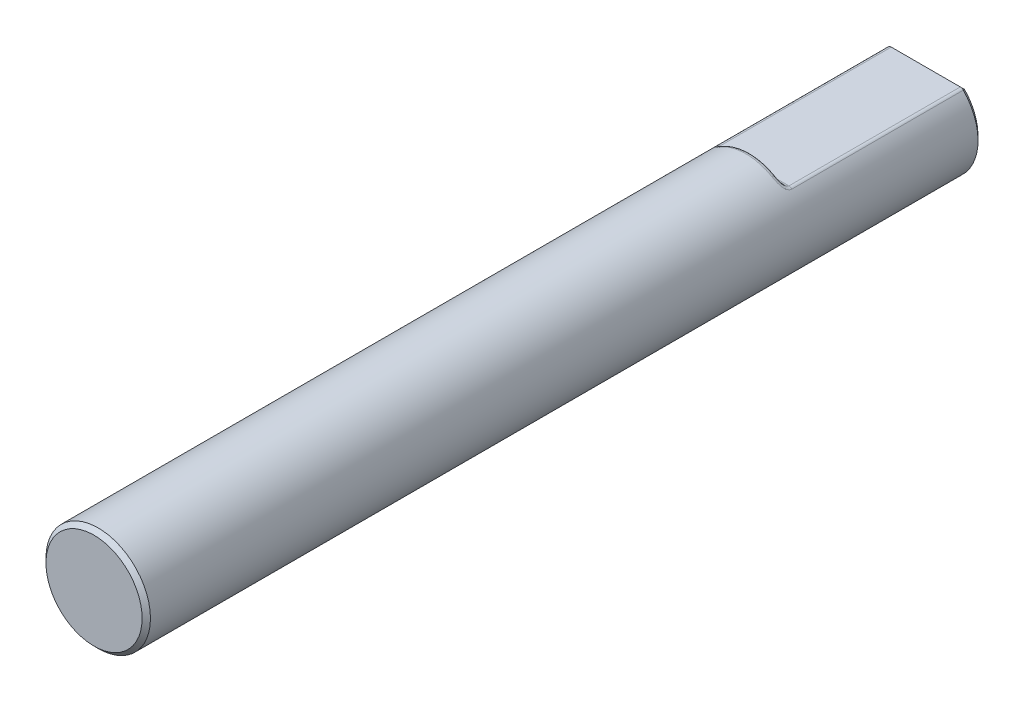
ISO-10303-21;
HEADER;
FILE_DESCRIPTION(('STEP AP214'),'2;1');
FILE_NAME('part.step','',(''),(''),'','','');
FILE_SCHEMA(('AUTOMOTIVE_DESIGN { 1 0 10303 214 1 1 1 1 }'));
ENDSEC;
DATA;
#1=APPLICATION_CONTEXT('core data for automotive mechanical design processes');
#2=APPLICATION_PROTOCOL_DEFINITION('international standard','automotive_design',2000,#1);
#3=PRODUCT_CONTEXT('',#1,'mechanical');
#4=PRODUCT('Part','Part','',(#3));
#5=PRODUCT_RELATED_PRODUCT_CATEGORY('part','',(#4));
#6=PRODUCT_DEFINITION_FORMATION('','',#4);
#7=PRODUCT_DEFINITION_CONTEXT('part definition',#1,'design');
#8=PRODUCT_DEFINITION('design','',#6,#7);
#9=PRODUCT_DEFINITION_SHAPE('','',#8);
#10=(LENGTH_UNIT() NAMED_UNIT(*) SI_UNIT(.MILLI.,.METRE.));
#11=(NAMED_UNIT(*) PLANE_ANGLE_UNIT() SI_UNIT($,.RADIAN.));
#12=(NAMED_UNIT(*) SI_UNIT($,.STERADIAN.) SOLID_ANGLE_UNIT());
#13=UNCERTAINTY_MEASURE_WITH_UNIT(LENGTH_MEASURE(1.E-05),#10,'distance_accuracy_value','');
#14=(GEOMETRIC_REPRESENTATION_CONTEXT(3) GLOBAL_UNCERTAINTY_ASSIGNED_CONTEXT((#13)) GLOBAL_UNIT_ASSIGNED_CONTEXT((#10,
#11,#12)) REPRESENTATION_CONTEXT('',''));
#15=CARTESIAN_POINT('',(0.,0.,0.));
#16=DIRECTION('',(0.,0.,1.));
#17=DIRECTION('',(1.,0.,0.));
#18=AXIS2_PLACEMENT_3D('',#15,#16,#17);
#19=CARTESIAN_POINT('',(0.,0.,50.8));
#20=DIRECTION('',(0.,0.,-1.));
#21=DIRECTION('',(-1.,0.,0.));
#22=AXIS2_PLACEMENT_3D('',#19,#20,#21);
#23=CYLINDRICAL_SURFACE('',#22,3.175);
#24=CARTESIAN_POINT('',(0.,0.,0.254000000000004));
#25=DIRECTION('',(0.,0.,1.));
#26=DIRECTION('',(1.,0.,0.));
#27=AXIS2_PLACEMENT_3D('',#24,#25,#26);
#28=CIRCLE('',#27,3.175);
#29=CARTESIAN_POINT('',(-2.28085258534348,2.20869565217391,0.254000000000004));
#30=VERTEX_POINT('',#29);
#31=CARTESIAN_POINT('',(2.28085258534348,2.20869565217391,0.254000000000004));
#32=VERTEX_POINT('',#31);
#33=EDGE_CURVE('E127',#30,#32,#28,.T.);
#34=ORIENTED_EDGE('',*,*,#33,.T.);
#35=DIRECTION('',(0.,0.,-1.));
#36=VECTOR('',#35,1.);
#37=CARTESIAN_POINT('',(2.28085258534348,2.20869565217391,50.8));
#38=LINE('',#37,#36);
#39=CARTESIAN_POINT('',(2.28085258534348,2.20869565217391,10.668));
#40=VERTEX_POINT('',#39);
#41=EDGE_CURVE('E227',#32,#40,#38,.F.);
#42=ORIENTED_EDGE('',*,*,#41,.T.);
#43=CARTESIAN_POINT('',(2.08147708691296,2.29465776440921,10.6022490499284));
#44=CARTESIAN_POINT('',(2.18936386379474,2.3017755032168,10.5756900123859));
#45=CARTESIAN_POINT('',(2.26247509447061,2.22751687915046,10.5364980998569));
#46=CARTESIAN_POINT('',(2.08704213800368,2.29182579741401,10.6127352009054));
#47=CARTESIAN_POINT('',(2.19483382835522,2.29661405397611,10.5902415242961));
#48=CARTESIAN_POINT('',(2.2685240630427,2.22136042915325,10.557470401812));
#49=CARTESIAN_POINT('',(2.09127161059837,2.28966018443801,10.6235854112991));
#50=CARTESIAN_POINT('',(2.19899567678026,2.29266629177763,10.6054541841004));
#51=CARTESIAN_POINT('',(2.2731213158654,2.21665257486143,10.5791708225988));
#52=CARTESIAN_POINT('',(2.09693841074738,2.28674969284816,10.6456238485392));
#53=CARTESIAN_POINT('',(2.20456628068673,2.28736847128426,10.6364319540538));
#54=CARTESIAN_POINT('',(2.27928088124954,2.21032541923893,10.6232476970779));
#55=CARTESIAN_POINT('',(2.09838256951604,2.28600133837143,10.6568111798799));
#56=CARTESIAN_POINT('',(2.20599150026584,2.28600284201359,10.6522216219));
#57=CARTESIAN_POINT('',(2.28085061904393,2.20869856168462,10.6456223597587));
#58=CARTESIAN_POINT('',(2.09838619099479,2.2859986590548,10.6792103368978));
#59=CARTESIAN_POINT('',(2.2059961718689,2.28599715252333,10.6838087081969));
#60=CARTESIAN_POINT('',(2.28085455542436,2.20869273706804,10.6904206737969));
#61=CARTESIAN_POINT('',(2.09694010091918,2.28674721009179,10.6904221683066));
#62=CARTESIAN_POINT('',(2.20457015007853,2.2873623338206,10.6996346421608));
#63=CARTESIAN_POINT('',(2.27928271837372,2.21032002191199,10.7128443366173));
#64=CARTESIAN_POINT('',(2.09124508751864,2.28967543925533,10.7124646912369));
#65=CARTESIAN_POINT('',(2.19896732211511,2.29269574713314,10.7306144268907));
#66=CARTESIAN_POINT('',(2.27309248644999,2.21668573753827,10.7569293824697));
#67=CARTESIAN_POINT('',(2.08699720571866,2.29185458557769,10.7232955228144));
#68=CARTESIAN_POINT('',(2.19478164244558,2.29667240400907,10.7457947946078));
#69=CARTESIAN_POINT('',(2.26847522366919,2.22142301222448,10.7785910456132));
#70=CARTESIAN_POINT('',(2.07595044465018,2.2974642569809,10.7442187468032));
#71=CARTESIAN_POINT('',(2.18392059477765,2.3069026139896,10.7748934919265));
#72=CARTESIAN_POINT('',(2.25646787455811,2.23361794985989,10.8204374936219));
#73=CARTESIAN_POINT('',(2.06916417277795,2.30088859527619,10.7543144988638));
#74=CARTESIAN_POINT('',(2.17723960723695,2.31316155570918,10.7888379839697));
#75=CARTESIAN_POINT('',(2.24909149192047,2.24106216327694,10.8406289977851));
#76=CARTESIAN_POINT('',(2.0533390852713,2.30876903921047,10.773628356883));
#77=CARTESIAN_POINT('',(2.16169366957577,2.32756298714666,10.8152092608687));
#78=CARTESIAN_POINT('',(2.23189030987301,2.25819356319842,10.8792567137962));
#79=CARTESIAN_POINT('',(2.04429730681642,2.31322650140487,10.7828452862371));
#80=CARTESIAN_POINT('',(2.15280269495554,2.33572867882211,10.8276462834935));
#81=CARTESIAN_POINT('',(2.22206229000665,2.2678836987371,10.8976905724349));
#82=CARTESIAN_POINT('',(2.02098081459409,2.32454002169663,10.8031634616703));
#83=CARTESIAN_POINT('',(2.1298989593879,2.35648115888799,10.8546466238543));
#84=CARTESIAN_POINT('',(2.19671827674762,2.29247830799507,10.938326923393));
#85=CARTESIAN_POINT('',(2.00596415863645,2.33170199441288,10.813881232634));
#86=CARTESIAN_POINT('',(2.1151434144868,2.36965333032366,10.8685247619315));
#87=CARTESIAN_POINT('',(2.18039582431238,2.30804781321404,10.9597624655657));
#88=CARTESIAN_POINT('',(1.97326577194165,2.34691281321471,10.8334930249975));
#89=CARTESIAN_POINT('',(2.08311483966224,2.39764310925851,10.8931020085138));
#90=CARTESIAN_POINT('',(2.14485409958122,2.34111481049926,10.9989860503166));
#91=CARTESIAN_POINT('',(1.95558163307324,2.35496245888326,10.8423853811602));
#92=CARTESIAN_POINT('',(2.06577703049759,2.41251048062678,10.9037877300662));
#93=CARTESIAN_POINT('',(2.12563220975182,2.35861404079051,11.0167707624204));
#94=CARTESIAN_POINT('',(1.91032606273425,2.37500469820587,10.8618052326057));
#95=CARTESIAN_POINT('',(2.02141535496309,2.44966648524454,10.9260146682914));
#96=CARTESIAN_POINT('',(2.07644137269369,2.40218412690304,11.0556104650698));
#97=CARTESIAN_POINT('',(1.88170767927852,2.38724120258011,10.8714671427826));
#98=CARTESIAN_POINT('',(1.99339768762638,2.47241543279391,10.9359028621589));
#99=CARTESIAN_POINT('',(2.04533443404104,2.4287852231007,11.0749342855267));
#100=CARTESIAN_POINT('',(1.82145126386168,2.41193885149924,10.8878579904839));
#101=CARTESIAN_POINT('',(1.93465543768717,2.51841820597802,10.9503739619204));
#102=CARTESIAN_POINT('',(1.97983833024153,2.48247576402772,11.1077159810065));
#103=CARTESIAN_POINT('',(1.78979611129448,2.42440090432795,10.8945689447679));
#104=CARTESIAN_POINT('',(1.90377328533236,2.54174707416492,10.9548168710213));
#105=CARTESIAN_POINT('',(1.94543055574109,2.50956718328915,11.1211378895483));
#106=CARTESIAN_POINT('',(1.70409217638077,2.45666350882904,10.9089348463087));
#107=CARTESIAN_POINT('',(1.81979372229936,2.60279896998063,10.960526783035));
#108=CARTESIAN_POINT('',(1.85227410478405,2.57970328011575,11.1498696925971));
#109=CARTESIAN_POINT('',(1.64833733543608,2.47621882415351,10.9145911135186));
#110=CARTESIAN_POINT('',(1.76548834456065,2.63980149990928,10.9576094400363));
#111=CARTESIAN_POINT('',(1.79167101678277,2.62221483512674,11.1611822270332));
#112=CARTESIAN_POINT('',(1.56287100562141,2.50397956699597,10.9196032814114));
#113=CARTESIAN_POINT('',(1.68382821837137,2.69197404713464,10.9467039697256));
#114=CARTESIAN_POINT('',(1.69877283219501,2.68256427607308,11.1712065628248));
#115=CARTESIAN_POINT('',(1.53434399991067,2.51289692220619,10.9207005582209));
#116=CARTESIAN_POINT('',(1.65623483168212,2.7090034987996,10.941891607098));
#117=CARTESIAN_POINT('',(1.66776521729313,2.70194983088047,11.1734011164429));
#118=CARTESIAN_POINT('',(1.47671654123674,2.5302250521972,10.921959105407));
#119=CARTESIAN_POINT('',(1.60056792251028,2.74223967470831,10.9302836248005));
#120=CARTESIAN_POINT('',(1.6051266752584,2.73961967869211,11.1759182108129));
#121=CARTESIAN_POINT('',(1.44761812910635,2.53863730506082,10.9221232532304));
#122=CARTESIAN_POINT('',(1.57245677980513,2.75844154181662,10.9234337887686));
#123=CARTESIAN_POINT('',(1.5734979664221,2.75790718491991,11.1762465064588));
#124=CARTESIAN_POINT('',(1.41823541644457,2.54679768400697,10.9219090220771));
#125=CARTESIAN_POINT('',(1.54451470751985,2.774006261644,10.9158261656988));
#126=CARTESIAN_POINT('',(1.54156023526584,2.7756471391456,11.1758180441542));
#127=(BOUNDED_SURFACE() B_SPLINE_SURFACE(3,2,((#43,#44,#45),(#46,#47,#48),(#49,#50,#51),(#52,
#53,#54),(#55,#56,#57),(#58,#59,#60),(#61,#62,#63),(#64,#65,#66),(#67,#68,#69),(#70,#71,#72),
(#73,#74,#75),(#76,#77,#78),(#79,#80,#81),(#82,#83,#84),(#85,#86,#87),(#88,#89,#90),(#91,#92,
#93),(#94,#95,#96),(#97,#98,#99),(#100,#101,#102),(#103,#104,#105),(#106,#107,#108),(#109,#110,
#111),(#112,#113,#114),(#115,#116,#117),(#118,#119,#120),(#121,#122,#123),(#124,#125,#126)),
.UNSPECIFIED.,.F.,.F.,.F.) B_SPLINE_SURFACE_WITH_KNOTS((4,2,2,2,2,2,2,2,2,2,2,2,2,4),(3,3),(0.,
0.0672104314705853,0.134255813086062,0.201430127025273,0.26857948396257,0.335399666159644,
0.402308089484164,0.491321385718032,0.580415527083602,0.706679723053762,0.833703060250032,
1.03955425802727,1.14065716571275,1.24144813718876),(0.,1.),
.UNSPECIFIED.) GEOMETRIC_REPRESENTATION_ITEM() RATIONAL_B_SPLINE_SURFACE(((1.,0.9158783432604,
1.),(1.,0.91749680132151,1.),(1.,0.918721732551247,1.),(1.,0.920359514561852,1.),(1.,
0.92077435219615,1.),(1.,0.920775090647766,1.),(1.,0.920359395835313,1.),(1.,0.91871468096907,
1.),(1.,0.917485963144106,1.),(1.,0.914268823994684,1.),(1.,0.912284156361139,1.),(1.,
0.907617155420817,1.),(1.,0.904933904254616,1.),(1.,0.897949439882381,1.),(1.,0.89340656300735,
1.),(1.,0.883384768646523,1.),(1.,0.877905004761794,1.),(1.,0.863707190237002,1.),(1.,
0.854591910951541,1.),(1.,0.835110248016913,1.),(1.,0.824736671822701,1.),(1.,0.796321963359922,
1.),(1.,0.777517554435384,1.),(1.,0.748410149790813,1.),(1.,0.738650250939946,1.),(1.,
0.718888204715718,1.),(1.,0.708886897667141,1.),(1.,0.69878597142492,1.))) REPRESENTATION_ITEM('') SURFACE());
#128=CARTESIAN_POINT('',(1.54156023526584,2.7756471391456,11.1758180441542));
#129=CARTESIAN_POINT('',(1.5734979664221,2.75790718491991,11.1762465064588));
#130=CARTESIAN_POINT('',(1.6051266752584,2.73961967869211,11.1759182108129));
#131=CARTESIAN_POINT('',(1.66776521729313,2.70194983088047,11.1734011164429));
#132=CARTESIAN_POINT('',(1.69877283219501,2.68256427607308,11.1712065628248));
#133=CARTESIAN_POINT('',(1.79167101678277,2.62221483512674,11.1611822270332));
#134=CARTESIAN_POINT('',(1.85227410478405,2.57970328011575,11.1498696925971));
#135=CARTESIAN_POINT('',(1.94543055574109,2.50956718328915,11.1211378895483));
#136=CARTESIAN_POINT('',(1.97983833024153,2.48247576402772,11.1077159810065));
#137=CARTESIAN_POINT('',(2.04533443404104,2.4287852231007,11.0749342855267));
#138=CARTESIAN_POINT('',(2.07644137269369,2.40218412690304,11.0556104650698));
#139=CARTESIAN_POINT('',(2.12563220975182,2.35861404079051,11.0167707624204));
#140=CARTESIAN_POINT('',(2.14485409958122,2.34111481049926,10.9989860503166));
#141=CARTESIAN_POINT('',(2.18039582431238,2.30804781321404,10.9597624655657));
#142=CARTESIAN_POINT('',(2.19671827674762,2.29247830799507,10.938326923393));
#143=CARTESIAN_POINT('',(2.22206229000665,2.2678836987371,10.8976905724349));
#144=CARTESIAN_POINT('',(2.23189030987301,2.25819356319842,10.8792567137962));
#145=CARTESIAN_POINT('',(2.24909149192047,2.24106216327694,10.8406289977851));
#146=CARTESIAN_POINT('',(2.25646787455811,2.23361794985989,10.8204374936219));
#147=CARTESIAN_POINT('',(2.26847522366919,2.22142301222448,10.7785910456132));
#148=CARTESIAN_POINT('',(2.27309248644999,2.21668573753827,10.7569293824697));
#149=CARTESIAN_POINT('',(2.27928271837372,2.21032002191199,10.7128443366173));
#150=CARTESIAN_POINT('',(2.28085455542436,2.20869273706804,10.6904206737969));
#151=CARTESIAN_POINT('',(2.28085061904392,2.20869856168462,10.6456223597587));
#152=CARTESIAN_POINT('',(2.27928088124954,2.21032541923893,10.6232476970779));
#153=CARTESIAN_POINT('',(2.27312131586541,2.21665257486143,10.5791708225988));
#154=CARTESIAN_POINT('',(2.2685240630427,2.22136042915325,10.557470401812));
#155=CARTESIAN_POINT('',(2.26247509447061,2.22751687915046,10.5364980998569));
#156=B_SPLINE_CURVE_WITH_KNOTS('',3,(#128,#129,#130,#131,#132,#133,#134,#135,#136,#137,#138,
#139,#140,#141,#142,#143,#144,#145,#146,#147,#148,#149,#150,#151,#152,#153,#154,#155),
.UNSPECIFIED.,.F.,.F.,(4,2,2,2,2,2,2,2,2,2,2,2,2,4),(0.,0.100790971476017,0.201893879161491,
0.407745076938732,0.534768414135002,0.661032610105162,0.750126751470732,0.8391400477046,
0.90604847102912,0.972868653226194,1.04001801016349,1.1071923241027,1.17423770571818,
1.24144813718876),.UNSPECIFIED.);
#157=CARTESIAN_POINT('',(1.56787252156188,2.76086956521513,11.176));
#158=VERTEX_POINT('',#157);
#159=EDGE_CURVE('E238',#158,#40,#156,.T.);
#160=ORIENTED_EDGE('',*,*,#159,.F.);
#161=CARTESIAN_POINT('',(0.,0.,11.176));
#162=DIRECTION('',(0.,0.,-1.));
#163=DIRECTION('',(-1.,0.,0.));
#164=AXIS2_PLACEMENT_3D('',#161,#162,#163);
#165=CIRCLE('',#164,3.175);
#166=CARTESIAN_POINT('',(-1.56787252156188,2.76086956521513,11.176));
#167=VERTEX_POINT('',#166);
#168=EDGE_CURVE('E283',#158,#167,#165,.F.);
#169=ORIENTED_EDGE('',*,*,#168,.T.);
#170=CARTESIAN_POINT('',(-0.762299234663434,2.67988837118684,10.8800076498778));
#171=CARTESIAN_POINT('',(-0.808454571196122,2.79883353609913,10.8015244187787));
#172=CARTESIAN_POINT('',(-0.830789738447543,2.92858721756073,10.8729597557011));
#173=CARTESIAN_POINT('',(-0.853124905698965,3.05834089902232,10.9443950926236));
#174=CARTESIAN_POINT('',(-0.828586124634168,3.0649747199714,11.0920152997555));
#175=CARTESIAN_POINT('',(-0.820250640114377,2.67205322069554,10.8851771222936));
#176=CARTESIAN_POINT('',(-0.867400480829563,2.79068636588262,10.8131719532479));
#177=CARTESIAN_POINT('',(-0.891541388471028,2.91580560722968,10.8856211442746));
#178=CARTESIAN_POINT('',(-0.914941398498865,3.04107868495901,10.9578892221924));
#179=CARTESIAN_POINT('',(-0.891576782731473,3.0479417841744,11.1023542448926));
#180=CARTESIAN_POINT('',(-0.877755361083727,2.66332341056633,10.8903129678));
#181=CARTESIAN_POINT('',(-0.92592877967618,2.78124472770227,10.8250620211124));
#182=CARTESIAN_POINT('',(-0.951425199159079,2.90151226555305,10.8983450372317));
#183=CARTESIAN_POINT('',(-0.976208377398107,3.02196998343128,10.9714725289282));
#184=CARTESIAN_POINT('',(-0.954081914220675,3.02896393604052,11.1126259357527));
#185=CARTESIAN_POINT('',(-0.991969683185946,2.64403509309197,10.8999690081169));
#186=CARTESIAN_POINT('',(-1.04169258045847,2.75960112540079,10.8482913709519));
#187=CARTESIAN_POINT('',(-1.06978127919812,2.86978499003571,10.9229611074155));
#188=CARTESIAN_POINT('',(-1.09718697316803,2.98015295286698,10.9974959142075));
#189=CARTESIAN_POINT('',(-1.07822791650723,2.98703281104265,11.1319380160807));
#190=CARTESIAN_POINT('',(-1.04867563922458,2.63347006104244,10.9044868998619));
#191=CARTESIAN_POINT('',(-1.09892243011284,2.74742454904997,10.8596318802492));
#192=CARTESIAN_POINT('',(-1.1282476339339,2.85233984149462,10.9348500970331));
#193=CARTESIAN_POINT('',(-1.1568943391921,2.95747962491751,11.0099416324129));
#194=CARTESIAN_POINT('',(-1.13986482524564,2.96406535003871,11.1409737994176));
#195=CARTESIAN_POINT('',(-1.16252815317474,2.61021004410484,10.9124215598666));
#196=CARTESIAN_POINT('',(-1.21352270951136,2.71979486388968,10.8811216260847));
#197=CARTESIAN_POINT('',(-1.24525649462567,2.8137550790047,10.9570370828334));
#198=CARTESIAN_POINT('',(-1.27627345706398,2.90795091162972,11.0328146121703));
#199=CARTESIAN_POINT('',(-1.26361755779691,2.91350009593807,11.1568431200567));
#200=CARTESIAN_POINT('',(-1.21964318194118,2.59746403821029,10.9158042486044));
#201=CARTESIAN_POINT('',(-1.27089237949075,2.704290954553,10.8912515754067));
#202=CARTESIAN_POINT('',(-1.30375598717389,2.79252628821361,10.9672816999427));
#203=CARTESIAN_POINT('',(-1.3359415550085,2.88103105583919,11.043209544924));
#204=CARTESIAN_POINT('',(-1.32569911079975,2.88579138761451,11.1636084983411));
#205=CARTESIAN_POINT('',(-1.33231038345131,2.57010599024989,10.9205910853952));
#206=CARTESIAN_POINT('',(-1.38386175957636,2.67019756054878,10.9088647282834));
#207=CARTESIAN_POINT('',(-1.41890340532494,2.74677756787298,10.9845746179531));
#208=CARTESIAN_POINT('',(-1.45327945016235,2.82362197790151,11.0601849922841));
#209=CARTESIAN_POINT('',(-1.44816346026832,2.82631737031352,11.1731821719086));
#210=CARTESIAN_POINT('',(-1.38786509293675,2.55549722008799,10.921998651877));
#211=CARTESIAN_POINT('',(-1.43950163114539,2.65164383103817,10.9163855501474));
#212=CARTESIAN_POINT('',(-1.47555436381539,2.72226340524148,10.9916284269442));
#213=CARTESIAN_POINT('',(-1.51099307671079,2.79317145232893,11.0668184745863));
#214=CARTESIAN_POINT('',(-1.50854901406201,2.79455917417128,11.1759973040521));
#215=CARTESIAN_POINT('',(-1.50112496213681,2.52333728166747,10.9220014495112));
#216=CARTESIAN_POINT('',(-1.55275280667336,2.61006022987343,10.9279682739116));
#217=CARTESIAN_POINT('',(-1.59089564996183,2.668131553955,11.0015197983011));
#218=CARTESIAN_POINT('',(-1.62833652349757,2.72653200495786,11.0750113068408));
#219=CARTESIAN_POINT('',(-1.63165756753965,2.72464626442251,11.1760028987021));
#220=CARTESIAN_POINT('',(-1.55867762864259,2.50564745309275,10.9203772122655));
#221=CARTESIAN_POINT('',(-1.61031457931399,2.58680457404335,10.9317871027363));
#222=CARTESIAN_POINT('',(-1.64941892987043,2.63826869890692,11.004000372813));
#223=CARTESIAN_POINT('',(-1.68790679925395,2.69007454522406,11.0762278826761));
#224=CARTESIAN_POINT('',(-1.69421481373488,2.68619011535732,11.1727544244942));
#225=CARTESIAN_POINT('',(-1.67001075069184,2.46871777282755,10.9125184534406));
#226=CARTESIAN_POINT('',(-1.72156336376832,2.53756082977369,10.9329348511462));
#227=CARTESIAN_POINT('',(-1.76254681505414,2.57579500199805,11.0014171831576));
#228=CARTESIAN_POINT('',(-1.8029353562413,2.61435645497089,11.0699129396472));
#229=CARTESIAN_POINT('',(-1.81522907684596,2.60590820186022,11.1570369069177));
#230=CARTESIAN_POINT('',(-1.72381835712975,2.44949187849227,10.9063219907653));
#231=CARTESIAN_POINT('',(-1.77536532155225,2.51160468414136,10.9303850677406));
#232=CARTESIAN_POINT('',(-1.81717971105311,2.54320880313272,10.9964153509943));
#233=CARTESIAN_POINT('',(-1.85851445504863,2.57511890165557,11.0625418994872));
#234=CARTESIAN_POINT('',(-1.87371560560339,2.56411277950396,11.1446439813612));
#235=CARTESIAN_POINT('',(-1.80292276077018,2.41923540582102,10.891767117344));
#236=CARTESIAN_POINT('',(-1.85454874796133,2.47031526978128,10.9194783522161));
#237=CARTESIAN_POINT('',(-1.89748038044137,2.49188332340885,10.980630906568));
#238=CARTESIAN_POINT('',(-1.94026600216108,2.51354502621428,11.0418110795954));
#239=CARTESIAN_POINT('',(-1.9596986529959,2.49833783864622,11.1155342347813));
#240=CARTESIAN_POINT('',(-1.83014752530398,2.40841285672401,10.885638641317));
#241=CARTESIAN_POINT('',(-1.88175783307414,2.45550250616874,10.9142830817489));
#242=CARTESIAN_POINT('',(-1.92511335621934,2.4735161861718,10.9734655380533));
#243=CARTESIAN_POINT('',(-1.96834795691031,2.49161288642991,11.0326880012796));
#244=CARTESIAN_POINT('',(-1.98929078832904,2.47481055781944,11.1032772829337));
#245=CARTESIAN_POINT('',(-1.88232889275729,2.38694093196964,10.8711232079258));
#246=CARTESIAN_POINT('',(-1.93389174398979,2.42601660470123,10.9007551317029));
#247=CARTESIAN_POINT('',(-1.97807707677935,2.43707121107891,10.95548564907));
#248=CARTESIAN_POINT('',(-2.02214167440272,2.44820908384398,11.0102581914785));
#249=CARTESIAN_POINT('',(-2.04600966598014,2.42813246050803,11.0742464161555));
#250=CARTESIAN_POINT('',(-1.90728581104324,2.37629153240375,10.8627365652268));
#251=CARTESIAN_POINT('',(-1.95884121824672,2.41133491965082,10.8924335155079));
#252=CARTESIAN_POINT('',(-2.00340814166487,2.41899333328762,10.9446716369701));
#253=CARTESIAN_POINT('',(-2.04787893216272,2.42672364611375,10.9969650373091));
#254=CARTESIAN_POINT('',(-2.07313675108772,2.4049815920483,11.0574731305553));
#255=CARTESIAN_POINT('',(-1.96885567046095,2.3491613790481,10.8371764972169));
#256=CARTESIAN_POINT('',(-2.02030174315196,2.37389199009283,10.8657309595062));
#257=CARTESIAN_POINT('',(-2.06590808978146,2.3729475380562,10.9105966768575));
#258=CARTESIAN_POINT('',(-2.11127065449561,2.37218095561986,10.955590682134));
#259=CARTESIAN_POINT('',(-2.14006051144552,2.34600299814739,11.0063529942691));
#260=CARTESIAN_POINT('',(-2.00309524629659,2.33316136080688,10.8177796496598));
#261=CARTESIAN_POINT('',(-2.05459496014833,2.35165349977411,10.8442867124251));
#262=CARTESIAN_POINT('',(-2.10067240156119,2.34580125726829,10.8837758682522));
#263=CARTESIAN_POINT('',(-2.14663147669669,2.34004318136349,10.9234014225315));
#264=CARTESIAN_POINT('',(-2.17727744186083,2.31122034994011,10.9675592992545));
#265=CARTESIAN_POINT('',(-2.0412845363251,2.31470629260322,10.7857659371126));
#266=CARTESIAN_POINT('',(-2.09283528964189,2.3259702817812,10.8075075874998));
#267=CARTESIAN_POINT('',(-2.13945748215966,2.3145098245304,10.8384188179936));
#268=CARTESIAN_POINT('',(-2.18606009283279,2.303065688487,10.8693537440218));
#269=CARTESIAN_POINT('',(-2.21878753939152,2.27110063595206,10.9035318742508));
#270=CARTESIAN_POINT('',(-2.05101801474579,2.30991767225333,10.7761604686422));
#271=CARTESIAN_POINT('',(-2.10257490865864,2.31930636558034,10.7963589161379));
#272=CARTESIAN_POINT('',(-2.14934427852263,2.30639321366069,10.8247071273591));
#273=CARTESIAN_POINT('',(-2.1961020580726,2.29348979396539,10.8530749739705));
#274=CARTESIAN_POINT('',(-2.22936740708671,2.26069059149311,10.8843209373304));
#275=CARTESIAN_POINT('',(-2.06800792883518,2.30147010591433,10.755968541626));
#276=CARTESIAN_POINT('',(-2.11957065181777,2.30755026745252,10.7727270000238));
#277=CARTESIAN_POINT('',(-2.16660345219586,2.29207800676935,10.7957210648044));
#278=CARTESIAN_POINT('',(-2.21362517623187,2.27661481461511,10.8187335625273));
#279=CARTESIAN_POINT('',(-2.24783470502556,2.2423263168695,10.8439370832904));
#280=CARTESIAN_POINT('',(-2.07527023134683,2.29780848630495,10.7453844834897));
#281=CARTESIAN_POINT('',(-2.12683924341141,2.30245000141317,10.7602441045373));
#282=CARTESIAN_POINT('',(-2.17398178483748,2.28587487126957,10.7804505075622));
#283=CARTESIAN_POINT('',(-2.22111918440745,2.26930404918142,10.8006708542938));
#284=CARTESIAN_POINT('',(-2.25572851227165,2.23436627448576,10.8227689669896));
#285=CARTESIAN_POINT('',(-2.08701515077473,2.29184663362126,10.7233781030269));
#286=CARTESIAN_POINT('',(-2.13859025700275,2.29414738585099,10.7341569930664));
#287=CARTESIAN_POINT('',(-2.18591518684787,2.27577662976745,10.7485886720305));
#288=CARTESIAN_POINT('',(-2.23323460153265,2.25741058404312,10.7630348598544));
#289=CARTESIAN_POINT('',(-2.26849472916527,2.22140572535448,10.7787562060434));
#290=CARTESIAN_POINT('',(-2.09147735730913,2.28955640223636,10.7119502890808));
#291=CARTESIAN_POINT('',(-2.14305743849332,2.29095535739497,10.7205403703218));
#292=CARTESIAN_POINT('',(-2.1904495257441,2.2718984799112,10.7319886684787));
#293=CARTESIAN_POINT('',(-2.23784029717486,2.25284272813122,10.7434443525085));
#294=CARTESIAN_POINT('',(-2.27334495361359,2.21642696140777,10.7559005781588));
#295=CARTESIAN_POINT('',(-2.09727971817923,2.28657216458006,10.6886839029537));
#296=CARTESIAN_POINT('',(-2.14886373905382,2.28679772458579,10.6927571114714));
#297=CARTESIAN_POINT('',(-2.19634581524727,2.26684541527033,10.6981379073875));
#298=CARTESIAN_POINT('',(-2.24382663418924,2.24689418534878,10.7035260894739));
#299=CARTESIAN_POINT('',(-2.2796518675694,2.20993948819315,10.7093678059102));
#300=CARTESIAN_POINT('',(-2.09861909174009,2.28587855749934,10.6768452287996));
#301=CARTESIAN_POINT('',(-2.15020481174799,2.28583072383518,10.6785840199393));
#302=CARTESIAN_POINT('',(-2.1977069724911,2.26567117652205,10.6808869882008));
#303=CARTESIAN_POINT('',(-2.24520928976181,2.24551150026103,10.6831890489175));
#304=CARTESIAN_POINT('',(-2.28110770840861,2.20843164673108,10.6856904576));
#305=CARTESIAN_POINT('',(-2.0981122219295,2.28614074727929,10.6545276907655));
#306=CARTESIAN_POINT('',(-2.14969741457079,2.28619617334504,10.6518783800826));
#307=CARTESIAN_POINT('',(-2.1971918663475,2.26611506720477,10.64837144871));
#308=CARTESIAN_POINT('',(-2.24468616058591,2.24603409154302,10.6448641628803));
#309=CARTESIAN_POINT('',(-2.28055676297087,2.20900162452606,10.6410553815303));
#310=CARTESIAN_POINT('',(-2.09660336787585,2.28692185698689,10.6440438789613));
#311=CARTESIAN_POINT('',(-2.14818658730501,2.28728520752625,10.6393333810272));
#312=CARTESIAN_POINT('',(-2.19565847877923,2.26743745889233,10.633099081964));
#313=CARTESIAN_POINT('',(-2.24312848768112,2.24759130952152,10.6268589872155));
#314=CARTESIAN_POINT('',(-2.27891670421489,2.21069968910487,10.6200877579223));
#315=CARTESIAN_POINT('',(-2.09114296873868,2.28972640646082,10.6233920303546));
#316=CARTESIAN_POINT('',(-2.14272331737759,2.29119179996325,10.6146779204575));
#317=CARTESIAN_POINT('',(-2.19010976434906,2.27218641859128,10.6030571597748));
#318=CARTESIAN_POINT('',(-2.23749581402249,2.25318138924119,10.5914298437462));
#319=CARTESIAN_POINT('',(-2.27298148775742,2.21679653578144,10.5787840607095));
#320=CARTESIAN_POINT('',(-2.08718836119378,2.29175140374508,10.6132244062582));
#321=CARTESIAN_POINT('',(-2.13876579552078,2.2940129611686,10.6025636404885));
#322=CARTESIAN_POINT('',(-2.18609132581973,2.27561562462426,10.5882882592501));
#323=CARTESIAN_POINT('',(-2.23341557657331,2.25721941030214,10.574000316868));
#324=CARTESIAN_POINT('',(-2.26868300129355,2.22119870378776,10.5584488125171));
#325=CARTESIAN_POINT('',(-2.08206194010851,2.29436066372538,10.6033678371508));
#326=CARTESIAN_POINT('',(-2.13363712020501,2.29764660609158,10.5908793690834));
#327=CARTESIAN_POINT('',(-2.18088249321621,2.28003493000732,10.5740133663434));
#328=CARTESIAN_POINT('',(-2.22812786622741,2.26242325392307,10.5571473636033));
#329=CARTESIAN_POINT('',(-2.26311080446577,2.22687100809865,10.5387356743016));
#330=(BOUNDED_SURFACE() B_SPLINE_SURFACE(3,2,((#170,#171,#172,#173,#174),(#175,#176,#177,#178,
#179),(#180,#181,#182,#183,#184),(#185,#186,#187,#188,#189),(#190,#191,#192,#193,#194),(#195,
#196,#197,#198,#199),(#200,#201,#202,#203,#204),(#205,#206,#207,#208,#209),(#210,#211,#212,#213,
#214),(#215,#216,#217,#218,#219),(#220,#221,#222,#223,#224),(#225,#226,#227,#228,#229),(#230,
#231,#232,#233,#234),(#235,#236,#237,#238,#239),(#240,#241,#242,#243,#244),(#245,#246,#247,#248,
#249),(#250,#251,#252,#253,#254),(#255,#256,#257,#258,#259),(#260,#261,#262,#263,#264),(#265,
#266,#267,#268,#269),(#270,#271,#272,#273,#274),(#275,#276,#277,#278,#279),(#280,#281,#282,#283,
#284),(#285,#286,#287,#288,#289),(#290,#291,#292,#293,#294),(#295,#296,#297,#298,#299),(#300,
#301,#302,#303,#304),(#305,#306,#307,#308,#309),(#310,#311,#312,#313,#314),(#315,#316,#317,#318,
#319),(#320,#321,#322,#323,#324),(#325,#326,#327,#328,#329)),.UNSPECIFIED.,.F.,.F.,
.F.) B_SPLINE_SURFACE_WITH_KNOTS((4,2,2,2,2,2,2,2,2,2,2,2,2,2,2,4),(3,2,3),(0.,
0.182760510356747,0.366184603421325,0.554704723257799,0.742898159108683,0.945245044260013,
1.14592634182732,1.25624208984294,1.36654247381168,1.54526716009423,1.61571839776284,
1.6860011900331,1.75679050984165,1.8275975265927,1.89053789737151,1.95355723923478),(0.,0.5,1.),
.UNSPECIFIED.) GEOMETRIC_REPRESENTATION_ITEM() RATIONAL_B_SPLINE_SURFACE(((1.,0.861368967830898,
1.,0.861368967830898,1.),(1.,0.866288240625045,1.,0.866288240625045,1.),(1.,0.871371504214175,
1.,0.871371504214175,1.),(1.,0.881711065348493,1.,0.881711065348493,1.),(1.,0.886967924145989,
1.,0.886967924145989,1.),(1.,0.897607247982836,1.,0.897607247982836,1.),(1.,0.902989145037586,
1.,0.902989145037586,1.),(1.,0.913587249999423,1.,0.913587249999423,1.),(1.,0.918803728865734,
1.,0.918803728865734,1.),(1.,0.929337071732957,1.,0.929337071732957,1.),(1.,0.934631980562339,
1.,0.934631980562339,1.),(1.,0.94469272833093,1.,0.94469272833093,1.),(1.,0.949462563471401,1.,
0.949462563471401,1.),(1.,0.956308002129858,1.,0.956308002129858,1.),(1.,0.958629648131995,1.,
0.958629648131995,1.),(1.,0.963013582601352,1.,0.963013582601352,1.),(1.,0.965075907145138,1.,
0.965075907145138,1.),(1.,0.970080240778956,1.,0.970080240778956,1.),(1.,0.972774317554616,1.,
0.972774317554616,1.),(1.,0.975714987497997,1.,0.975714987497997,1.),(1.,0.976455547900149,1.,
0.976455547900149,1.),(1.,0.977738728864047,1.,0.977738728864047,1.),(1.,0.978281818456567,1.,
0.978281818456567,1.),(1.,0.979155768003715,1.,0.979155768003715,1.),(1.,0.979485070212517,1.,
0.979485070212517,1.),(1.,0.979912598367567,1.,0.979912598367567,1.),(1.,0.980010766525434,1.,
0.980010766525434,1.),(1.,0.97997358235551,1.,0.97997358235551,1.),(1.,0.979862962402858,1.,
0.979862962402858,1.),(1.,0.979460217950009,1.,0.979460217950009,1.),(1.,0.979167865890775,1.,
0.979167865890775,1.),(1.,0.978787165034222,1.,0.978787165034222,1.))) REPRESENTATION_ITEM('') SURFACE());
#331=CARTESIAN_POINT('',(-2.26311080446577,2.22687100809865,10.5387356743016));
#332=CARTESIAN_POINT('',(-2.26868300129355,2.22119870378776,10.5584488125171));
#333=CARTESIAN_POINT('',(-2.27298148775742,2.21679653578145,10.5787840607095));
#334=CARTESIAN_POINT('',(-2.27891670421489,2.21069968910487,10.6200877579223));
#335=CARTESIAN_POINT('',(-2.28055676297087,2.20900162452606,10.6410553815303));
#336=CARTESIAN_POINT('',(-2.28110770840861,2.20843164673108,10.6856904576));
#337=CARTESIAN_POINT('',(-2.2796518675694,2.20993948819315,10.7093678059102));
#338=CARTESIAN_POINT('',(-2.27334495361359,2.21642696140777,10.7559005781588));
#339=CARTESIAN_POINT('',(-2.26849472916527,2.22140572535448,10.7787562060434));
#340=CARTESIAN_POINT('',(-2.25572851227165,2.23436627448576,10.8227689669896));
#341=CARTESIAN_POINT('',(-2.24783470502556,2.2423263168695,10.8439370832904));
#342=CARTESIAN_POINT('',(-2.22936740708671,2.26069059149311,10.8843209373304));
#343=CARTESIAN_POINT('',(-2.21878753939152,2.27110063595206,10.9035318742508));
#344=CARTESIAN_POINT('',(-2.17727744186083,2.31122034994011,10.9675592992545));
#345=CARTESIAN_POINT('',(-2.14006051144552,2.34600299814739,11.0063529942691));
#346=CARTESIAN_POINT('',(-2.07313675108772,2.4049815920483,11.0574731305553));
#347=CARTESIAN_POINT('',(-2.04600966598014,2.42813246050803,11.0742464161555));
#348=CARTESIAN_POINT('',(-1.98929078832904,2.47481055781944,11.1032772829337));
#349=CARTESIAN_POINT('',(-1.9596986529959,2.49833783864623,11.1155342347813));
#350=CARTESIAN_POINT('',(-1.87371560560339,2.56411277950396,11.1446439813612));
#351=CARTESIAN_POINT('',(-1.81522907684596,2.60590820186022,11.1570369069177));
#352=CARTESIAN_POINT('',(-1.69421481373488,2.68619011535732,11.1727544244942));
#353=CARTESIAN_POINT('',(-1.63165756753965,2.72464626442251,11.1760028987021));
#354=CARTESIAN_POINT('',(-1.50854901406201,2.79455917417128,11.1759973040521));
#355=CARTESIAN_POINT('',(-1.44816346026832,2.82631737031352,11.1731821719086));
#356=CARTESIAN_POINT('',(-1.32569911079975,2.88579138761451,11.1636084983411));
#357=CARTESIAN_POINT('',(-1.26361755779691,2.91350009593807,11.1568431200567));
#358=CARTESIAN_POINT('',(-1.13986482524564,2.96406535003871,11.1409737994176));
#359=CARTESIAN_POINT('',(-1.07822791650723,2.98703281104265,11.1319380160807));
#360=CARTESIAN_POINT('',(-0.954081914220675,3.02896393604052,11.1126259357527));
#361=CARTESIAN_POINT('',(-0.891576782731473,3.0479417841744,11.1023542448926));
#362=CARTESIAN_POINT('',(-0.828586124634168,3.0649747199714,11.0920152997555));
#363=B_SPLINE_CURVE_WITH_KNOTS('',3,(#331,#332,#333,#334,#335,#336,#337,#338,#339,#340,#341,
#342,#343,#344,#345,#346,#347,#348,#349,#350,#351,#352,#353,#354,#355,#356,#357,#358,#359,#360,
#361,#362),.UNSPECIFIED.,.F.,.F.,(4,2,2,2,2,2,2,2,2,2,2,2,2,2,2,4),(0.,0.0630193418632715,
0.125959712642075,0.196766729393131,0.267556049201678,0.33783884147194,0.408290079140546,
0.587014765423097,0.697315149391833,0.80763089740746,1.00831219497476,1.21065908012609,
1.39885251597698,1.58737263581345,1.77079672887803,1.95355723923478),.UNSPECIFIED.);
#364=CARTESIAN_POINT('',(-2.28085258534348,2.20869565217391,10.668));
#365=VERTEX_POINT('',#364);
#366=EDGE_CURVE('E277',#365,#167,#363,.T.);
#367=ORIENTED_EDGE('',*,*,#366,.F.);
#368=DIRECTION('',(0.,0.,-1.));
#369=VECTOR('',#368,1.);
#370=CARTESIAN_POINT('',(-2.28085258534348,2.20869565217391,50.8));
#371=LINE('',#370,#369);
#372=EDGE_CURVE('E230',#365,#30,#371,.T.);
#373=ORIENTED_EDGE('',*,*,#372,.T.);
#374=EDGE_LOOP('',(#34,#42,#160,#169,#367,#373));
#375=FACE_BOUND('',#374,.T.);
#376=CARTESIAN_POINT('',(0.,0.,50.546));
#377=DIRECTION('',(0.,0.,1.));
#378=DIRECTION('',(1.,0.,0.));
#379=AXIS2_PLACEMENT_3D('',#376,#377,#378);
#380=CIRCLE('',#379,3.175);
#381=CARTESIAN_POINT('',(3.175,0.,50.546));
#382=VERTEX_POINT('',#381);
#383=EDGE_CURVE('E124',#382,#382,#380,.F.);
#384=ORIENTED_EDGE('',*,*,#383,.T.);
#385=EDGE_LOOP('',(#384));
#386=FACE_BOUND('',#385,.T.);
#387=ADVANCED_FACE('F36',(#375,#386),#23,.T.);
#388=CARTESIAN_POINT('',(0.,0.,50.8));
#389=DIRECTION('',(0.,0.,1.));
#390=DIRECTION('',(1.,0.,0.));
#391=AXIS2_PLACEMENT_3D('',#388,#389,#390);
#392=PLANE('',#391);
#393=CARTESIAN_POINT('',(0.,0.,50.8));
#394=DIRECTION('',(0.,0.,1.));
#395=DIRECTION('',(1.,0.,0.));
#396=AXIS2_PLACEMENT_3D('',#393,#394,#395);
#397=CIRCLE('',#396,2.921);
#398=CARTESIAN_POINT('',(2.921,0.,50.8));
#399=VERTEX_POINT('',#398);
#400=EDGE_CURVE('E133',#399,#399,#397,.T.);
#401=ORIENTED_EDGE('',*,*,#400,.T.);
#402=EDGE_LOOP('',(#401));
#403=FACE_BOUND('',#402,.T.);
#404=ADVANCED_FACE('F214',(#403),#392,.T.);
#405=CARTESIAN_POINT('',(0.,0.,0.));
#406=DIRECTION('',(0.,0.,1.));
#407=DIRECTION('',(1.,0.,0.));
#408=AXIS2_PLACEMENT_3D('',#405,#406,#407);
#409=PLANE('',#408);
#410=CARTESIAN_POINT('',(0.,0.,0.));
#411=DIRECTION('',(0.,0.,1.));
#412=DIRECTION('',(1.,0.,0.));
#413=AXIS2_PLACEMENT_3D('',#410,#411,#412);
#414=CIRCLE('',#413,2.92099999999999);
#415=CARTESIAN_POINT('',(2.09838437851603,2.03199999999996,0.));
#416=VERTEX_POINT('',#415);
#417=CARTESIAN_POINT('',(-2.09838437851603,2.03199999999996,0.));
#418=VERTEX_POINT('',#417);
#419=EDGE_CURVE('E119',#416,#418,#414,.F.);
#420=ORIENTED_EDGE('',*,*,#419,.T.);
#421=DIRECTION('',(1.,0.,0.));
#422=VECTOR('',#421,1.);
#423=CARTESIAN_POINT('',(0.,2.03199999999999,0.));
#424=LINE('',#423,#422);
#425=EDGE_CURVE('E111',#418,#416,#424,.T.);
#426=ORIENTED_EDGE('',*,*,#425,.T.);
#427=EDGE_LOOP('',(#420,#426));
#428=FACE_BOUND('',#427,.T.);
#429=ADVANCED_FACE('F123',(#428),#409,.F.);
#430=CARTESIAN_POINT('',(0.,2.286,10.922));
#431=DIRECTION('',(0.,-1.,0.));
#432=DIRECTION('',(0.,0.,-1.));
#433=AXIS2_PLACEMENT_3D('',#430,#431,#432);
#434=PLANE('',#433);
#435=DIRECTION('',(-1.,0.,0.));
#436=VECTOR('',#435,1.);
#437=CARTESIAN_POINT('',(0.,2.286,10.668));
#438=LINE('',#437,#436);
#439=CARTESIAN_POINT('',(-2.09838437851601,2.286,10.668));
#440=VERTEX_POINT('',#439);
#441=CARTESIAN_POINT('',(2.09838437851601,2.286,10.668));
#442=VERTEX_POINT('',#441);
#443=EDGE_CURVE('E136',#440,#442,#438,.F.);
#444=ORIENTED_EDGE('',*,*,#443,.T.);
#445=DIRECTION('',(0.,0.,-1.));
#446=VECTOR('',#445,1.);
#447=CARTESIAN_POINT('',(2.09838437851601,2.286,10.922));
#448=LINE('',#447,#446);
#449=CARTESIAN_POINT('',(2.09838437851601,2.286,0.254000000000003));
#450=VERTEX_POINT('',#449);
#451=EDGE_CURVE('E303',#442,#450,#448,.T.);
#452=ORIENTED_EDGE('',*,*,#451,.T.);
#453=DIRECTION('',(-1.,0.,0.));
#454=VECTOR('',#453,1.);
#455=CARTESIAN_POINT('',(0.,2.286,0.254000000000003));
#456=LINE('',#455,#454);
#457=CARTESIAN_POINT('',(-2.09838437851601,2.286,0.254000000000003));
#458=VERTEX_POINT('',#457);
#459=EDGE_CURVE('E116',#450,#458,#456,.T.);
#460=ORIENTED_EDGE('',*,*,#459,.T.);
#461=DIRECTION('',(0.,0.,-1.));
#462=VECTOR('',#461,1.);
#463=CARTESIAN_POINT('',(-2.09838437851601,2.286,10.922));
#464=LINE('',#463,#462);
#465=EDGE_CURVE('E281',#458,#440,#464,.F.);
#466=ORIENTED_EDGE('',*,*,#465,.T.);
#467=EDGE_LOOP('',(#444,#452,#460,#466));
#468=FACE_BOUND('',#467,.T.);
#469=ADVANCED_FACE('F307',(#468),#434,.F.);
#470=CARTESIAN_POINT('',(0.,0.,10.922));
#471=DIRECTION('',(0.,0.,-1.));
#472=DIRECTION('',(-1.,0.,0.));
#473=AXIS2_PLACEMENT_3D('',#470,#471,#472);
#474=PLANE('',#473);
#475=DIRECTION('',(-1.,0.,0.));
#476=VECTOR('',#475,1.);
#477=CARTESIAN_POINT('',(0.,2.54,10.922));
#478=LINE('',#477,#476);
#479=CARTESIAN_POINT('',(1.44244271983693,2.54,10.922));
#480=VERTEX_POINT('',#479);
#481=CARTESIAN_POINT('',(-1.44244271983693,2.54,10.922));
#482=VERTEX_POINT('',#481);
#483=EDGE_CURVE('E46',#480,#482,#478,.T.);
#484=ORIENTED_EDGE('',*,*,#483,.T.);
#485=CARTESIAN_POINT('',(0.,0.,10.922));
#486=DIRECTION('',(0.,0.,-1.));
#487=DIRECTION('',(-1.,0.,0.));
#488=AXIS2_PLACEMENT_3D('',#485,#486,#487);
#489=CIRCLE('',#488,2.921);
#490=EDGE_CURVE('E11',#482,#480,#489,.T.);
#491=ORIENTED_EDGE('',*,*,#490,.T.);
#492=EDGE_LOOP('',(#484,#491));
#493=FACE_BOUND('',#492,.T.);
#494=ADVANCED_FACE('F309',(#493),#474,.T.);
#495=CARTESIAN_POINT('',(0.,0.,0.254000000000004));
#496=DIRECTION('',(0.,0.,1.));
#497=DIRECTION('',(1.,0.,0.));
#498=AXIS2_PLACEMENT_3D('',#495,#496,#497);
#499=CONICAL_SURFACE('',#498,3.175,0.785398163397453);
#500=CARTESIAN_POINT('',(2.09838437851606,2.03199999999999,0.));
#501=CARTESIAN_POINT('',(2.11627496025241,2.07425206019354,0.0422520601935454));
#502=CARTESIAN_POINT('',(2.13396886090422,2.1165447664964,0.0845447664964057));
#503=CARTESIAN_POINT('',(2.16896328429769,2.20121143323619,0.169211433236198));
#504=CARTESIAN_POINT('',(2.18626380739322,2.24358539359999,0.211585393599996));
#505=CARTESIAN_POINT('',(2.20336764975811,2.28599999999997,0.253999999999976));
#506=B_SPLINE_CURVE_WITH_KNOTS('',3,(#500,#501,#502,#503,#504,#505),.UNSPECIFIED.,.F.,.F.,(4,2,
4),(0.,0.187119697514847,0.374239226690295),.UNSPECIFIED.);
#507=CARTESIAN_POINT('',(2.19555756077828,2.26667716686764,0.234677166867645));
#508=VERTEX_POINT('',#507);
#509=EDGE_CURVE('E105',#508,#416,#506,.F.);
#510=ORIENTED_EDGE('',*,*,#509,.F.);
#511=CARTESIAN_POINT('',(2.19555756077828,2.26667716686764,0.234677166867645));
#512=CARTESIAN_POINT('',(2.20536502726484,2.26263329400695,0.238594356178138));
#513=CARTESIAN_POINT('',(2.21511161317881,2.25786138317125,0.241995730735676));
#514=CARTESIAN_POINT('',(2.23394532689624,2.24706358618255,0.247548823829242));
#515=CARTESIAN_POINT('',(2.24304237238651,2.24106842422569,0.249727007814086));
#516=CARTESIAN_POINT('',(2.25687493933014,2.23058991903797,0.252164883345823));
#517=CARTESIAN_POINT('',(2.26184980492236,2.22651597232991,0.252845744699545));
#518=CARTESIAN_POINT('',(2.27156395216082,2.21792344941499,0.253766863908112));
#519=CARTESIAN_POINT('',(2.27629917166947,2.21339963576481,0.254001080468702));
#520=CARTESIAN_POINT('',(2.28085258534362,2.20869565217415,0.254000000000251));
#521=B_SPLINE_CURVE_WITH_KNOTS('',3,(#511,#512,#513,#514,#515,#516,#517,#518,#519,#520),
.UNSPECIFIED.,.F.,.F.,(4,2,2,2,4),(0.,0.0339398803215153,0.0671139422328696,0.0864798257805037,
0.106105843185441),.UNSPECIFIED.);
#522=EDGE_CURVE('E235',#508,#32,#521,.T.);
#523=ORIENTED_EDGE('',*,*,#522,.T.);
#524=ORIENTED_EDGE('',*,*,#33,.F.);
#525=CARTESIAN_POINT('',(-2.28085258534348,2.20869565217391,0.254000000000004));
#526=CARTESIAN_POINT('',(-2.27299017481888,2.21684140241,0.25401616018047));
#527=CARTESIAN_POINT('',(-2.26456885611785,2.22442491719536,0.253304701822628));
#528=CARTESIAN_POINT('',(-2.24712792034896,2.23817828755042,0.250578604512092));
#529=CARTESIAN_POINT('',(-2.23812535671277,2.24437536630021,0.248592724589173));
#530=CARTESIAN_POINT('',(-2.22349859080057,2.25313924329134,0.24452433693601));
#531=CARTESIAN_POINT('',(-2.21802241938727,2.25614546969155,0.242823770712487));
#532=CARTESIAN_POINT('',(-2.20689355964054,2.26174091216404,0.239034132459005));
#533=CARTESIAN_POINT('',(-2.20123950146713,2.26432419042313,0.236940291252322));
#534=CARTESIAN_POINT('',(-2.19555756077769,2.26667716686789,0.234677166867415));
#535=B_SPLINE_CURVE_WITH_KNOTS('',3,(#525,#526,#527,#528,#529,#530,#531,#532,#533,#534),
.UNSPECIFIED.,.F.,.F.,(4,2,2,2,4),(0.,0.0338937770114427,0.0670483755260341,0.0864471830406215,
0.106098512974387),.UNSPECIFIED.);
#536=CARTESIAN_POINT('',(-2.19555756077445,2.2666771668582,0.234677166858201));
#537=VERTEX_POINT('',#536);
#538=EDGE_CURVE('E282',#30,#537,#535,.T.);
#539=ORIENTED_EDGE('',*,*,#538,.T.);
#540=CARTESIAN_POINT('',(-2.20336764975798,2.286,0.254000000000003));
#541=CARTESIAN_POINT('',(-2.18626380739315,2.24358539360001,0.211585393600012));
#542=CARTESIAN_POINT('',(-2.16896328429766,2.2012114332362,0.169211433236204));
#543=CARTESIAN_POINT('',(-2.13396886090425,2.11654476649639,0.0845447664963999));
#544=CARTESIAN_POINT('',(-2.11627496025245,2.07425206019353,0.042252060193536));
#545=CARTESIAN_POINT('',(-2.09838437851611,2.03199999999998,0.));
#546=B_SPLINE_CURVE_WITH_KNOTS('',3,(#540,#541,#542,#543,#544,#545),.UNSPECIFIED.,.F.,.F.,(4,2,
4),(0.,0.187119529175448,0.374239226690295),.UNSPECIFIED.);
#547=EDGE_CURVE('E117',#418,#537,#546,.F.);
#548=ORIENTED_EDGE('',*,*,#547,.F.);
#549=ORIENTED_EDGE('',*,*,#419,.F.);
#550=EDGE_LOOP('',(#510,#523,#524,#539,#548,#549));
#551=FACE_BOUND('',#550,.T.);
#552=ADVANCED_FACE('F120',(#551),#499,.T.);
#553=CARTESIAN_POINT('',(0.,2.286,0.254000000000003));
#554=DIRECTION('',(0.,-0.707106781186542,0.707106781186553));
#555=DIRECTION('',(-1.,0.,0.));
#556=AXIS2_PLACEMENT_3D('',#553,#554,#555);
#557=PLANE('',#556);
#558=ORIENTED_EDGE('',*,*,#459,.F.);
#559=CARTESIAN_POINT('',(2.09838437851601,2.032,0.));
#560=DIRECTION('',(0.,-0.707106781186542,0.707106781186553));
#561=DIRECTION('',(0.,-0.707106781186553,-0.707106781186542));
#562=AXIS2_PLACEMENT_3D('',#559,#560,#561);
#563=ELLIPSE('',#562,0.359210244842763,0.254);
#564=EDGE_CURVE('E113',#450,#508,#563,.F.);
#565=ORIENTED_EDGE('',*,*,#564,.T.);
#566=ORIENTED_EDGE('',*,*,#509,.T.);
#567=ORIENTED_EDGE('',*,*,#425,.F.);
#568=ORIENTED_EDGE('',*,*,#547,.T.);
#569=CARTESIAN_POINT('',(-2.09838437851601,2.032,0.));
#570=DIRECTION('',(0.,-0.707106781186542,0.707106781186553));
#571=DIRECTION('',(0.,-0.707106781186553,-0.707106781186542));
#572=AXIS2_PLACEMENT_3D('',#569,#570,#571);
#573=ELLIPSE('',#572,0.359210244842763,0.254);
#574=EDGE_CURVE('E301',#537,#458,#573,.F.);
#575=ORIENTED_EDGE('',*,*,#574,.T.);
#576=EDGE_LOOP('',(#558,#565,#566,#567,#568,#575));
#577=FACE_BOUND('',#576,.T.);
#578=ADVANCED_FACE('F108',(#577),#557,.F.);
#579=CARTESIAN_POINT('',(0.,0.,50.8));
#580=DIRECTION('',(0.,0.,-1.));
#581=DIRECTION('',(-1.,0.,0.));
#582=AXIS2_PLACEMENT_3D('',#579,#580,#581);
#583=CONICAL_SURFACE('',#582,2.921,0.78539816339744);
#584=ORIENTED_EDGE('',*,*,#383,.F.);
#585=EDGE_LOOP('',(#584));
#586=FACE_BOUND('',#585,.T.);
#587=ORIENTED_EDGE('',*,*,#400,.F.);
#588=EDGE_LOOP('',(#587));
#589=FACE_BOUND('',#588,.T.);
#590=ADVANCED_FACE('F157',(#586,#589),#583,.T.);
#591=CARTESIAN_POINT('',(-2.09838437851601,2.032,50.8));
#592=DIRECTION('',(0.,0.,-1.));
#593=DIRECTION('',(-1.,0.,0.));
#594=AXIS2_PLACEMENT_3D('',#591,#592,#593);
#595=CYLINDRICAL_SURFACE('',#594,0.254);
#596=ORIENTED_EDGE('',*,*,#538,.F.);
#597=ORIENTED_EDGE('',*,*,#372,.F.);
#598=CARTESIAN_POINT('',(-2.09838437851601,2.032,10.668));
#599=DIRECTION('',(0.,0.,1.));
#600=DIRECTION('',(1.,0.,0.));
#601=AXIS2_PLACEMENT_3D('',#598,#599,#600);
#602=CIRCLE('',#601,0.254);
#603=EDGE_CURVE('E41',#440,#365,#602,.T.);
#604=ORIENTED_EDGE('',*,*,#603,.F.);
#605=ORIENTED_EDGE('',*,*,#465,.F.);
#606=ORIENTED_EDGE('',*,*,#574,.F.);
#607=EDGE_LOOP('',(#596,#597,#604,#605,#606));
#608=FACE_BOUND('',#607,.T.);
#609=ADVANCED_FACE('F38',(#608),#595,.T.);
#610=ORIENTED_EDGE('',*,*,#603,.T.);
#611=ORIENTED_EDGE('',*,*,#366,.T.);
#612=CARTESIAN_POINT('',(-1.44244271983693,2.53999999999792,11.176));
#613=DIRECTION('',(-0.869565217390593,-0.493818117027363,0.));
#614=DIRECTION('',(0.493818117027363,-0.869565217390593,0.));
#615=AXIS2_PLACEMENT_3D('',#612,#613,#614);
#616=CIRCLE('',#615,0.254);
#617=EDGE_CURVE('E203',#482,#167,#616,.F.);
#618=ORIENTED_EDGE('',*,*,#617,.F.);
#619=CARTESIAN_POINT('',(-0.762299234663434,2.67988837118684,10.8800076498778));
#620=CARTESIAN_POINT('',(-0.820250640114377,2.67205322069554,10.8851771222936));
#621=CARTESIAN_POINT('',(-0.877755361083727,2.66332341056633,10.8903129678));
#622=CARTESIAN_POINT('',(-0.991969683185946,2.64403509309197,10.8999690081169));
#623=CARTESIAN_POINT('',(-1.04867563922458,2.63347006104244,10.9044868998619));
#624=CARTESIAN_POINT('',(-1.16252815317474,2.61021004410484,10.9124215598666));
#625=CARTESIAN_POINT('',(-1.21964318194118,2.59746403821029,10.9158042486044));
#626=CARTESIAN_POINT('',(-1.33231038345131,2.57010599024989,10.9205910853952));
#627=CARTESIAN_POINT('',(-1.38786509293675,2.55549722008799,10.921998651877));
#628=CARTESIAN_POINT('',(-1.50112496213681,2.52333728166747,10.9220014495112));
#629=CARTESIAN_POINT('',(-1.55867762864259,2.50564745309275,10.9203772122655));
#630=CARTESIAN_POINT('',(-1.67001075069184,2.46871777282755,10.9125184534406));
#631=CARTESIAN_POINT('',(-1.72381835712975,2.44949187849227,10.9063219907653));
#632=CARTESIAN_POINT('',(-1.80292276077018,2.41923540582102,10.891767117344));
#633=CARTESIAN_POINT('',(-1.83014752530398,2.40841285672401,10.885638641317));
#634=CARTESIAN_POINT('',(-1.88232889275729,2.38694093196964,10.8711232079258));
#635=CARTESIAN_POINT('',(-1.90728581104324,2.37629153240375,10.8627365652268));
#636=CARTESIAN_POINT('',(-1.96885567046095,2.3491613790481,10.8371764972169));
#637=CARTESIAN_POINT('',(-2.00309524629659,2.33316136080688,10.8177796496598));
#638=CARTESIAN_POINT('',(-2.0412845363251,2.31470629260322,10.7857659371126));
#639=CARTESIAN_POINT('',(-2.05101801474579,2.30991767225333,10.7761604686422));
#640=CARTESIAN_POINT('',(-2.06800792883518,2.30147010591433,10.755968541626));
#641=CARTESIAN_POINT('',(-2.07527023134683,2.29780848630495,10.7453844834897));
#642=CARTESIAN_POINT('',(-2.08701515077473,2.29184663362126,10.7233781030269));
#643=CARTESIAN_POINT('',(-2.09147735730913,2.28955640223636,10.7119502890808));
#644=CARTESIAN_POINT('',(-2.09727971817923,2.28657216458006,10.6886839029537));
#645=CARTESIAN_POINT('',(-2.09861909174009,2.28587855749934,10.6768452287996));
#646=CARTESIAN_POINT('',(-2.0981122219295,2.28614074727929,10.6545276907655));
#647=CARTESIAN_POINT('',(-2.09660336787585,2.28692185698689,10.6440438789613));
#648=CARTESIAN_POINT('',(-2.09114296873868,2.28972640646082,10.6233920303546));
#649=CARTESIAN_POINT('',(-2.08718836119378,2.29175140374508,10.6132244062582));
#650=CARTESIAN_POINT('',(-2.08206194010851,2.29436066372538,10.6033678371508));
#651=B_SPLINE_CURVE_WITH_KNOTS('',3,(#619,#620,#621,#622,#623,#624,#625,#626,#627,#628,#629,
#630,#631,#632,#633,#634,#635,#636,#637,#638,#639,#640,#641,#642,#643,#644,#645,#646,#647,#648,
#649,#650),.UNSPECIFIED.,.F.,.F.,(4,2,2,2,2,2,2,2,2,2,2,2,2,2,2,4),(0.,0.182760510356747,
0.366184603421325,0.554704723257799,0.742898159108683,0.945245044260013,1.14592634182732,
1.25624208984294,1.36654247381168,1.54526716009423,1.61571839776284,1.6860011900331,
1.75679050984165,1.8275975265927,1.89053789737151,1.95355723923478),.UNSPECIFIED.);
#652=EDGE_CURVE('E197',#440,#482,#651,.F.);
#653=ORIENTED_EDGE('',*,*,#652,.F.);
#654=EDGE_LOOP('',(#610,#611,#618,#653));
#655=FACE_BOUND('',#654,.T.);
#656=ADVANCED_FACE('F172',(#655),#330,.T.);
#657=CARTESIAN_POINT('',(0.,0.,11.176));
#658=DIRECTION('',(0.,0.,-1.));
#659=DIRECTION('',(-1.,0.,0.));
#660=AXIS2_PLACEMENT_3D('',#657,#658,#659);
#661=TOROIDAL_SURFACE('',#660,2.921,0.254);
#662=ORIENTED_EDGE('',*,*,#617,.T.);
#663=ORIENTED_EDGE('',*,*,#168,.F.);
#664=CARTESIAN_POINT('',(1.44244271983693,2.53999999999792,11.176));
#665=DIRECTION('',(0.869565217390593,-0.493818117027363,0.));
#666=DIRECTION('',(0.493818117027363,0.869565217390593,0.));
#667=AXIS2_PLACEMENT_3D('',#664,#665,#666);
#668=CIRCLE('',#667,0.254);
#669=EDGE_CURVE('E255',#480,#158,#668,.T.);
#670=ORIENTED_EDGE('',*,*,#669,.F.);
#671=ORIENTED_EDGE('',*,*,#490,.F.);
#672=EDGE_LOOP('',(#662,#663,#670,#671));
#673=FACE_BOUND('',#672,.T.);
#674=ADVANCED_FACE('F179',(#673),#661,.T.);
#675=CARTESIAN_POINT('',(0.,2.54,10.668));
#676=DIRECTION('',(-1.,0.,0.));
#677=DIRECTION('',(0.,0.,1.));
#678=AXIS2_PLACEMENT_3D('',#675,#676,#677);
#679=CYLINDRICAL_SURFACE('',#678,0.254);
#680=ORIENTED_EDGE('',*,*,#652,.T.);
#681=ORIENTED_EDGE('',*,*,#483,.F.);
#682=CARTESIAN_POINT('',(2.08147708691296,2.29465776440921,10.6022490499284));
#683=CARTESIAN_POINT('',(2.08704213800368,2.29182579741401,10.6127352009054));
#684=CARTESIAN_POINT('',(2.09127161059837,2.28966018443801,10.6235854112991));
#685=CARTESIAN_POINT('',(2.09693841074738,2.28674969284816,10.6456238485392));
#686=CARTESIAN_POINT('',(2.09838256951604,2.28600133837143,10.6568111798799));
#687=CARTESIAN_POINT('',(2.09838619099479,2.2859986590548,10.6792103368978));
#688=CARTESIAN_POINT('',(2.09694010091918,2.28674721009179,10.6904221683066));
#689=CARTESIAN_POINT('',(2.09124508751864,2.28967543925533,10.7124646912369));
#690=CARTESIAN_POINT('',(2.08699720571866,2.29185458557769,10.7232955228144));
#691=CARTESIAN_POINT('',(2.07595044465018,2.2974642569809,10.7442187468032));
#692=CARTESIAN_POINT('',(2.06916417277795,2.30088859527619,10.7543144988638));
#693=CARTESIAN_POINT('',(2.0533390852713,2.30876903921047,10.773628356883));
#694=CARTESIAN_POINT('',(2.04429730681642,2.31322650140487,10.7828452862371));
#695=CARTESIAN_POINT('',(2.02098081459409,2.32454002169663,10.8031634616703));
#696=CARTESIAN_POINT('',(2.00596415863645,2.33170199441288,10.813881232634));
#697=CARTESIAN_POINT('',(1.97326577194165,2.34691281321471,10.8334930249975));
#698=CARTESIAN_POINT('',(1.95558163307324,2.35496245888326,10.8423853811602));
#699=CARTESIAN_POINT('',(1.91032606273425,2.37500469820587,10.8618052326057));
#700=CARTESIAN_POINT('',(1.88170767927852,2.38724120258011,10.8714671427826));
#701=CARTESIAN_POINT('',(1.82145126386168,2.41193885149924,10.8878579904839));
#702=CARTESIAN_POINT('',(1.78979611129448,2.42440090432795,10.8945689447679));
#703=CARTESIAN_POINT('',(1.70409217638077,2.45666350882904,10.9089348463087));
#704=CARTESIAN_POINT('',(1.64833733543608,2.47621882415351,10.9145911135186));
#705=CARTESIAN_POINT('',(1.56287100562141,2.50397956699597,10.9196032814114));
#706=CARTESIAN_POINT('',(1.53434399991067,2.51289692220619,10.9207005582209));
#707=CARTESIAN_POINT('',(1.47671654123674,2.5302250521972,10.921959105407));
#708=CARTESIAN_POINT('',(1.44761812910635,2.53863730506082,10.9221232532304));
#709=CARTESIAN_POINT('',(1.41823541644457,2.54679768400697,10.9219090220771));
#710=B_SPLINE_CURVE_WITH_KNOTS('',3,(#682,#683,#684,#685,#686,#687,#688,#689,#690,#691,#692,
#693,#694,#695,#696,#697,#698,#699,#700,#701,#702,#703,#704,#705,#706,#707,#708,#709),
.UNSPECIFIED.,.F.,.F.,(4,2,2,2,2,2,2,2,2,2,2,2,2,4),(0.,0.0672104314705853,0.134255813086062,
0.201430127025273,0.26857948396257,0.335399666159644,0.402308089484164,0.491321385718032,
0.580415527083602,0.706679723053762,0.833703060250032,1.03955425802727,1.14065716571275,
1.24144813718876),.UNSPECIFIED.);
#711=EDGE_CURVE('E59',#442,#480,#710,.T.);
#712=ORIENTED_EDGE('',*,*,#711,.F.);
#713=ORIENTED_EDGE('',*,*,#443,.F.);
#714=EDGE_LOOP('',(#680,#681,#712,#713));
#715=FACE_BOUND('',#714,.T.);
#716=ADVANCED_FACE('F186',(#715),#679,.F.);
#717=ORIENTED_EDGE('',*,*,#669,.T.);
#718=ORIENTED_EDGE('',*,*,#159,.T.);
#719=CARTESIAN_POINT('',(2.09838437851601,2.032,10.668));
#720=DIRECTION('',(0.,0.,1.));
#721=DIRECTION('',(1.,0.,0.));
#722=AXIS2_PLACEMENT_3D('',#719,#720,#721);
#723=CIRCLE('',#722,0.254);
#724=EDGE_CURVE('E237',#442,#40,#723,.F.);
#725=ORIENTED_EDGE('',*,*,#724,.F.);
#726=ORIENTED_EDGE('',*,*,#711,.T.);
#727=EDGE_LOOP('',(#717,#718,#725,#726));
#728=FACE_BOUND('',#727,.T.);
#729=ADVANCED_FACE('F210',(#728),#127,.T.);
#730=CARTESIAN_POINT('',(2.09838437851601,2.032,50.8));
#731=DIRECTION('',(0.,0.,-1.));
#732=DIRECTION('',(-1.,0.,0.));
#733=AXIS2_PLACEMENT_3D('',#730,#731,#732);
#734=CYLINDRICAL_SURFACE('',#733,0.254);
#735=ORIENTED_EDGE('',*,*,#724,.T.);
#736=ORIENTED_EDGE('',*,*,#41,.F.);
#737=ORIENTED_EDGE('',*,*,#522,.F.);
#738=ORIENTED_EDGE('',*,*,#564,.F.);
#739=ORIENTED_EDGE('',*,*,#451,.F.);
#740=EDGE_LOOP('',(#735,#736,#737,#738,#739));
#741=FACE_BOUND('',#740,.T.);
#742=ADVANCED_FACE('F234',(#741),#734,.T.);
#743=CLOSED_SHELL('',(#387,#404,#429,#469,#494,#552,#578,#590,#609,#656,#674,#716,#729,#742));
#744=MANIFOLD_SOLID_BREP('B2',#743);
#745=ADVANCED_BREP_SHAPE_REPRESENTATION('',(#18,#744),#14);
#746=SHAPE_DEFINITION_REPRESENTATION(#9,#745);
ENDSEC;
END-ISO-10303-21;
